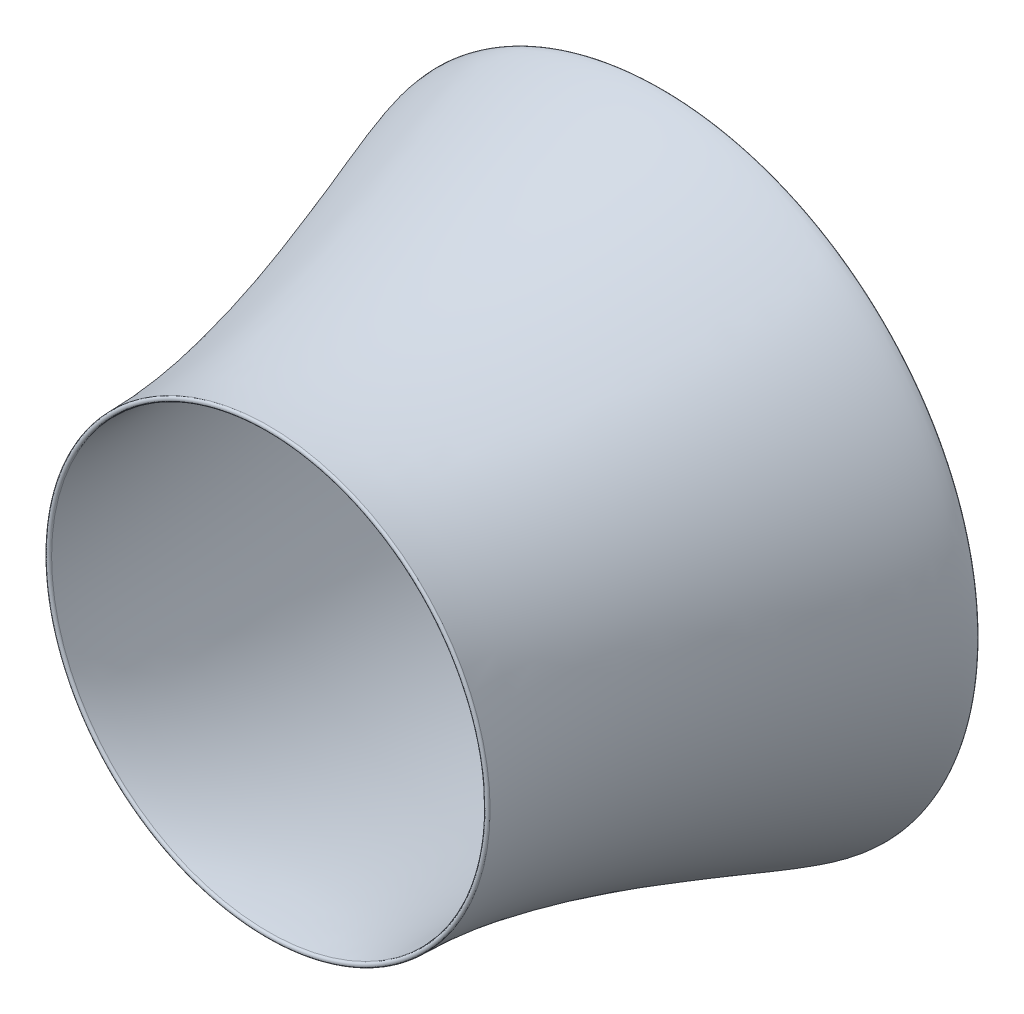
ISO-10303-21;
HEADER;
FILE_DESCRIPTION(('STEP AP214'),'2;1');
FILE_NAME('part.step','',(''),(''),'','','');
FILE_SCHEMA(('AUTOMOTIVE_DESIGN { 1 0 10303 214 1 1 1 1 }'));
ENDSEC;
DATA;
#1=APPLICATION_CONTEXT('core data for automotive mechanical design processes');
#2=APPLICATION_PROTOCOL_DEFINITION('international standard','automotive_design',2000,#1);
#3=PRODUCT_CONTEXT('',#1,'mechanical');
#4=PRODUCT('Part','Part','',(#3));
#5=PRODUCT_RELATED_PRODUCT_CATEGORY('part','',(#4));
#6=PRODUCT_DEFINITION_FORMATION('','',#4);
#7=PRODUCT_DEFINITION_CONTEXT('part definition',#1,'design');
#8=PRODUCT_DEFINITION('design','',#6,#7);
#9=PRODUCT_DEFINITION_SHAPE('','',#8);
#10=(LENGTH_UNIT() NAMED_UNIT(*) SI_UNIT(.MILLI.,.METRE.));
#11=(NAMED_UNIT(*) PLANE_ANGLE_UNIT() SI_UNIT($,.RADIAN.));
#12=(NAMED_UNIT(*) SI_UNIT($,.STERADIAN.) SOLID_ANGLE_UNIT());
#13=UNCERTAINTY_MEASURE_WITH_UNIT(LENGTH_MEASURE(1.E-05),#10,'distance_accuracy_value','');
#14=(GEOMETRIC_REPRESENTATION_CONTEXT(3) GLOBAL_UNCERTAINTY_ASSIGNED_CONTEXT((#13)) GLOBAL_UNIT_ASSIGNED_CONTEXT((#10,
#11,#12)) REPRESENTATION_CONTEXT('',''));
#15=CARTESIAN_POINT('',(0.,0.,0.));
#16=DIRECTION('',(0.,0.,1.));
#17=DIRECTION('',(1.,0.,0.));
#18=AXIS2_PLACEMENT_3D('',#15,#16,#17);
#19=CARTESIAN_POINT('',(-1013.88328831173,0.,1702.16481501066));
#20=CARTESIAN_POINT('',(-1013.88328831173,0.,1714.86481501066));
#21=CARTESIAN_POINT('',(-992.18018653963,0.,1714.86481501066));
#22=CARTESIAN_POINT('',(-992.18018653963,0.,1702.16481501066));
#23=B_SPLINE_CURVE_WITH_KNOTS('',3,(#19,#20,#21,#22),.UNSPECIFIED.,.F.,.F.,(4,4),(0.,1.),.UNSPECIFIED.);
#24=CARTESIAN_POINT('',(0.,0.,1104.75683012291));
#25=DIRECTION('',(0.,0.,1.));
#26=AXIS1_PLACEMENT('',#24,#25);
#27=SURFACE_OF_REVOLUTION('',#23,#26);
#28=CARTESIAN_POINT('',(0.,0.,1702.16481501066));
#29=DIRECTION('',(0.,0.,1.));
#30=DIRECTION('',(1.,0.,0.));
#31=AXIS2_PLACEMENT_3D('',#28,#29,#30);
#32=CIRCLE('',#31,992.18018653963);
#33=CARTESIAN_POINT('',(992.18018653963,0.,1702.16481501066));
#34=VERTEX_POINT('',#33);
#35=EDGE_CURVE('E47',#34,#34,#32,.T.);
#36=ORIENTED_EDGE('',*,*,#35,.F.);
#37=EDGE_LOOP('',(#36));
#38=FACE_BOUND('',#37,.T.);
#39=CARTESIAN_POINT('',(0.,0.,1702.16481501066));
#40=DIRECTION('',(0.,0.,1.));
#41=DIRECTION('',(1.,0.,0.));
#42=AXIS2_PLACEMENT_3D('',#39,#40,#41);
#43=CIRCLE('',#42,1013.88328831173);
#44=CARTESIAN_POINT('',(1013.88328831173,0.,1702.16481501066));
#45=VERTEX_POINT('',#44);
#46=EDGE_CURVE('E11',#45,#45,#43,.T.);
#47=ORIENTED_EDGE('',*,*,#46,.T.);
#48=EDGE_LOOP('',(#47));
#49=FACE_BOUND('',#48,.T.);
#50=ADVANCED_FACE('F40',(#38,#49),#27,.T.);
#51=CARTESIAN_POINT('',(-1013.88328831173,0.,1702.16481501066));
#52=DIRECTION('',(0.,0.,1.));
#53=DIRECTION('',(1.,0.,0.));
#54=AXIS2_PLACEMENT_3D('',#51,#52,#53);
#55=PLANE('',#54);
#56=ORIENTED_EDGE('',*,*,#46,.F.);
#57=EDGE_LOOP('',(#56));
#58=FACE_BOUND('',#57,.T.);
#59=ORIENTED_EDGE('',*,*,#35,.T.);
#60=EDGE_LOOP('',(#59));
#61=FACE_BOUND('',#60,.T.);
#62=ADVANCED_FACE('F59',(#58,#61),#55,.F.);
#63=CLOSED_SHELL('',(#50,#62));
#64=MANIFOLD_SOLID_BREP('B2',#63);
#65=CARTESIAN_POINT('',(-1232.82685614713,0.,-94.6857482648209));
#66=CARTESIAN_POINT('',(-1232.82685614713,0.,-111.619081598154));
#67=CARTESIAN_POINT('',(-1447.71591346705,0.,-111.619081598154));
#68=CARTESIAN_POINT('',(-1447.71591346705,0.,-94.6857482648209));
#69=B_SPLINE_CURVE_WITH_KNOTS('',3,(#65,#66,#67,#68),.UNSPECIFIED.,.F.,.F.,(4,4),(0.,1.),.UNSPECIFIED.);
#70=CARTESIAN_POINT('',(0.,0.,99.6847843209707));
#71=DIRECTION('',(0.,0.,1.));
#72=AXIS1_PLACEMENT('',#70,#71);
#73=SURFACE_OF_REVOLUTION('',#69,#72);
#74=CARTESIAN_POINT('',(0.,0.,-94.6857482648209));
#75=DIRECTION('',(0.,0.,1.));
#76=DIRECTION('',(1.,0.,0.));
#77=AXIS2_PLACEMENT_3D('',#74,#75,#76);
#78=CIRCLE('',#77,1447.71591346705);
#79=CARTESIAN_POINT('',(1447.71591346705,0.,-94.6857482648209));
#80=VERTEX_POINT('',#79);
#81=EDGE_CURVE('E39',#80,#80,#78,.T.);
#82=ORIENTED_EDGE('',*,*,#81,.F.);
#83=EDGE_LOOP('',(#82));
#84=FACE_BOUND('',#83,.T.);
#85=CARTESIAN_POINT('',(0.,0.,-94.6857482648209));
#86=DIRECTION('',(0.,0.,1.));
#87=DIRECTION('',(1.,0.,0.));
#88=AXIS2_PLACEMENT_3D('',#85,#86,#87);
#89=CIRCLE('',#88,1232.82685614713);
#90=CARTESIAN_POINT('',(1232.82685614713,0.,-94.6857482648209));
#91=VERTEX_POINT('',#90);
#92=EDGE_CURVE('E93',#91,#91,#89,.T.);
#93=ORIENTED_EDGE('',*,*,#92,.T.);
#94=EDGE_LOOP('',(#93));
#95=FACE_BOUND('',#94,.T.);
#96=ADVANCED_FACE('F86',(#84,#95),#73,.T.);
#97=CARTESIAN_POINT('',(-1447.71591346705,0.,-94.6857482648209));
#98=DIRECTION('',(0.,0.,-1.));
#99=DIRECTION('',(-1.,0.,0.));
#100=AXIS2_PLACEMENT_3D('',#97,#98,#99);
#101=PLANE('',#100);
#102=ORIENTED_EDGE('',*,*,#92,.F.);
#103=EDGE_LOOP('',(#102));
#104=FACE_BOUND('',#103,.T.);
#105=ORIENTED_EDGE('',*,*,#81,.T.);
#106=EDGE_LOOP('',(#105));
#107=FACE_BOUND('',#106,.T.);
#108=ADVANCED_FACE('F106',(#104,#107),#101,.F.);
#109=CLOSED_SHELL('',(#96,#108));
#110=MANIFOLD_SOLID_BREP('B6',#109);
#111=CARTESIAN_POINT('',(-992.180186539631,0.,1702.16481501066));
#112=CARTESIAN_POINT('',(-953.763419276328,0.,1319.30470065935));
#113=CARTESIAN_POINT('',(-1110.50259966873,0.,571.312977982744));
#114=CARTESIAN_POINT('',(-1182.71220096208,0.,46.3815707746957));
#115=CARTESIAN_POINT('',(-1232.82685614713,0.,-94.6857482648209));
#116=B_SPLINE_CURVE_WITH_KNOTS('',3,(#111,#112,#113,#114,#115),.UNSPECIFIED.,.F.,.F.,(4,1,4),
(0.,0.793493092504956,1.),.UNSPECIFIED.);
#117=CARTESIAN_POINT('',(0.,0.,99.6847843209707));
#118=DIRECTION('',(0.,0.,1.));
#119=AXIS1_PLACEMENT('',#117,#118);
#120=SURFACE_OF_REVOLUTION('',#116,#119);
#121=CARTESIAN_POINT('',(0.,0.,-94.6857482648209));
#122=DIRECTION('',(0.,0.,1.));
#123=DIRECTION('',(1.,0.,0.));
#124=AXIS2_PLACEMENT_3D('',#121,#122,#123);
#125=CIRCLE('',#124,1232.82685614713);
#126=CARTESIAN_POINT('',(1232.82685614713,0.,-94.6857482648209));
#127=VERTEX_POINT('',#126);
#128=EDGE_CURVE('E85',#127,#127,#125,.T.);
#129=ORIENTED_EDGE('',*,*,#128,.F.);
#130=EDGE_LOOP('',(#129));
#131=FACE_BOUND('',#130,.T.);
#132=CARTESIAN_POINT('',(0.,0.,1702.16481501066));
#133=DIRECTION('',(0.,0.,1.));
#134=DIRECTION('',(1.,0.,0.));
#135=AXIS2_PLACEMENT_3D('',#132,#133,#134);
#136=CIRCLE('',#135,992.18018653963);
#137=CARTESIAN_POINT('',(992.18018653963,0.,1702.16481501066));
#138=VERTEX_POINT('',#137);
#139=EDGE_CURVE('E140',#138,#138,#136,.T.);
#140=ORIENTED_EDGE('',*,*,#139,.T.);
#141=EDGE_LOOP('',(#140));
#142=FACE_BOUND('',#141,.T.);
#143=ADVANCED_FACE('F125',(#131,#142),#120,.T.);
#144=CARTESIAN_POINT('',(-1232.82685614713,0.,-94.6857482648209));
#145=DIRECTION('',(0.,0.,1.));
#146=DIRECTION('',(1.,0.,0.));
#147=AXIS2_PLACEMENT_3D('',#144,#145,#146);
#148=PLANE('',#147);
#149=CARTESIAN_POINT('',(0.,0.,-94.6857482648209));
#150=DIRECTION('',(0.,0.,1.));
#151=DIRECTION('',(1.,0.,0.));
#152=AXIS2_PLACEMENT_3D('',#149,#150,#151);
#153=CIRCLE('',#152,1447.71591346705);
#154=CARTESIAN_POINT('',(1447.71591346705,0.,-94.6857482648209));
#155=VERTEX_POINT('',#154);
#156=EDGE_CURVE('E132',#155,#155,#153,.T.);
#157=ORIENTED_EDGE('',*,*,#156,.F.);
#158=EDGE_LOOP('',(#157));
#159=FACE_BOUND('',#158,.T.);
#160=ORIENTED_EDGE('',*,*,#128,.T.);
#161=EDGE_LOOP('',(#160));
#162=FACE_BOUND('',#161,.T.);
#163=ADVANCED_FACE('F159',(#159,#162),#148,.F.);
#164=CARTESIAN_POINT('',(-1447.71591346705,0.,-94.6857482648209));
#165=CARTESIAN_POINT('',(-1447.71591346705,0.,30.6982041114716));
#166=CARTESIAN_POINT('',(-1013.88328831173,0.,971.855694625423));
#167=CARTESIAN_POINT('',(-1013.88328831173,0.,1702.16481501066));
#168=B_SPLINE_CURVE_WITH_KNOTS('',3,(#164,#165,#166,#167),.UNSPECIFIED.,.F.,.F.,(4,4),(0.,1.),.UNSPECIFIED.);
#169=CARTESIAN_POINT('',(0.,0.,99.6847843209707));
#170=DIRECTION('',(0.,0.,1.));
#171=AXIS1_PLACEMENT('',#169,#170);
#172=SURFACE_OF_REVOLUTION('',#168,#171);
#173=CARTESIAN_POINT('',(0.,0.,1702.16481501066));
#174=DIRECTION('',(0.,0.,1.));
#175=DIRECTION('',(1.,0.,0.));
#176=AXIS2_PLACEMENT_3D('',#173,#174,#175);
#177=CIRCLE('',#176,1013.88328831173);
#178=CARTESIAN_POINT('',(1013.88328831173,0.,1702.16481501066));
#179=VERTEX_POINT('',#178);
#180=EDGE_CURVE('E136',#179,#179,#177,.T.);
#181=ORIENTED_EDGE('',*,*,#180,.F.);
#182=EDGE_LOOP('',(#181));
#183=FACE_BOUND('',#182,.T.);
#184=ORIENTED_EDGE('',*,*,#156,.T.);
#185=EDGE_LOOP('',(#184));
#186=FACE_BOUND('',#185,.T.);
#187=ADVANCED_FACE('F155',(#183,#186),#172,.T.);
#188=CARTESIAN_POINT('',(-992.18018653963,0.,1702.16481501066));
#189=DIRECTION('',(0.,0.,-1.));
#190=DIRECTION('',(-1.,0.,0.));
#191=AXIS2_PLACEMENT_3D('',#188,#189,#190);
#192=PLANE('',#191);
#193=ORIENTED_EDGE('',*,*,#139,.F.);
#194=EDGE_LOOP('',(#193));
#195=FACE_BOUND('',#194,.T.);
#196=ORIENTED_EDGE('',*,*,#180,.T.);
#197=EDGE_LOOP('',(#196));
#198=FACE_BOUND('',#197,.T.);
#199=ADVANCED_FACE('F158',(#195,#198),#192,.F.);
#200=CLOSED_SHELL('',(#143,#163,#187,#199));
#201=MANIFOLD_SOLID_BREP('B34',#200);
#202=ADVANCED_BREP_SHAPE_REPRESENTATION('',(#18,#64,#110,#201),#14);
#203=SHAPE_DEFINITION_REPRESENTATION(#9,#202);
ENDSEC;
END-ISO-10303-21;
